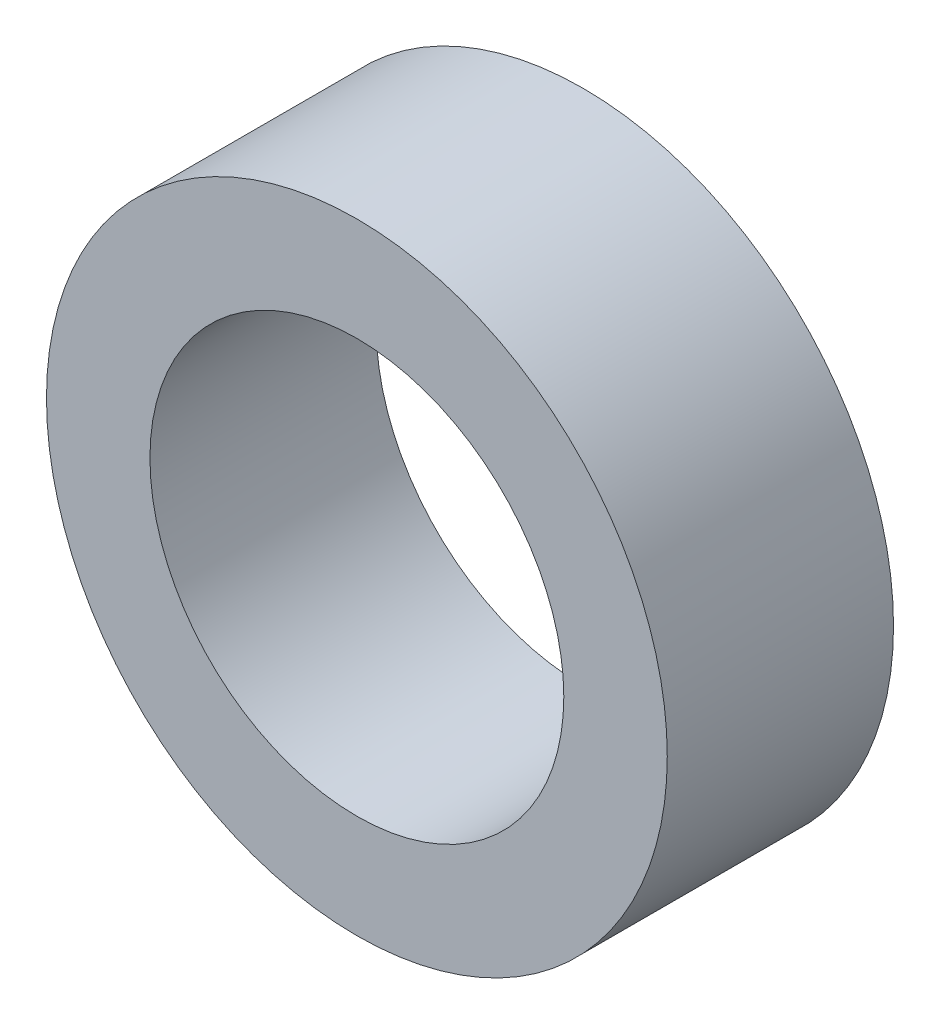
ISO-10303-21;
HEADER;
FILE_DESCRIPTION(('STEP AP214'),'2;1');
FILE_NAME('part.step','',(''),(''),'','','');
FILE_SCHEMA(('AUTOMOTIVE_DESIGN { 1 0 10303 214 1 1 1 1 }'));
ENDSEC;
DATA;
#1=APPLICATION_CONTEXT('core data for automotive mechanical design processes');
#2=APPLICATION_PROTOCOL_DEFINITION('international standard','automotive_design',2000,#1);
#3=PRODUCT_CONTEXT('',#1,'mechanical');
#4=PRODUCT('Part','Part','',(#3));
#5=PRODUCT_RELATED_PRODUCT_CATEGORY('part','',(#4));
#6=PRODUCT_DEFINITION_FORMATION('','',#4);
#7=PRODUCT_DEFINITION_CONTEXT('part definition',#1,'design');
#8=PRODUCT_DEFINITION('design','',#6,#7);
#9=PRODUCT_DEFINITION_SHAPE('','',#8);
#10=(LENGTH_UNIT() NAMED_UNIT(*) SI_UNIT(.MILLI.,.METRE.));
#11=(NAMED_UNIT(*) PLANE_ANGLE_UNIT() SI_UNIT($,.RADIAN.));
#12=(NAMED_UNIT(*) SI_UNIT($,.STERADIAN.) SOLID_ANGLE_UNIT());
#13=UNCERTAINTY_MEASURE_WITH_UNIT(LENGTH_MEASURE(1.E-05),#10,'distance_accuracy_value','');
#14=(GEOMETRIC_REPRESENTATION_CONTEXT(3) GLOBAL_UNCERTAINTY_ASSIGNED_CONTEXT((#13)) GLOBAL_UNIT_ASSIGNED_CONTEXT((#10,
#11,#12)) REPRESENTATION_CONTEXT('',''));
#15=CARTESIAN_POINT('',(0.,0.,0.));
#16=DIRECTION('',(0.,0.,1.));
#17=DIRECTION('',(1.,0.,0.));
#18=AXIS2_PLACEMENT_3D('',#15,#16,#17);
#19=CARTESIAN_POINT('',(-17.7,-16.75,1.64));
#20=DIRECTION('',(0.,0.,1.));
#21=DIRECTION('',(1.,0.,0.));
#22=AXIS2_PLACEMENT_3D('',#19,#20,#21);
#23=PLANE('',#22);
#24=CARTESIAN_POINT('',(-32.9,-2.5,1.64));
#25=DIRECTION('',(0.,0.,1.));
#26=DIRECTION('',(1.,0.,0.));
#27=AXIS2_PLACEMENT_3D('',#24,#25,#26);
#28=CIRCLE('',#27,1.5);
#29=CARTESIAN_POINT('',(-31.4,-2.5,1.64));
#30=VERTEX_POINT('',#29);
#31=EDGE_CURVE('E47',#30,#30,#28,.T.);
#32=ORIENTED_EDGE('',*,*,#31,.F.);
#33=EDGE_LOOP('',(#32));
#34=FACE_BOUND('',#33,.T.);
#35=CARTESIAN_POINT('',(-32.9,-2.5,1.64));
#36=DIRECTION('',(0.,0.,1.));
#37=DIRECTION('',(1.,0.,0.));
#38=AXIS2_PLACEMENT_3D('',#35,#36,#37);
#39=CIRCLE('',#38,2.25);
#40=CARTESIAN_POINT('',(-30.65,-2.5,1.64));
#41=VERTEX_POINT('',#40);
#42=EDGE_CURVE('E11',#41,#41,#39,.T.);
#43=ORIENTED_EDGE('',*,*,#42,.T.);
#44=EDGE_LOOP('',(#43));
#45=FACE_BOUND('',#44,.T.);
#46=ADVANCED_FACE('F17',(#34,#45),#23,.T.);
#47=CARTESIAN_POINT('',(-17.7,-16.75,0.));
#48=DIRECTION('',(0.,0.,1.));
#49=DIRECTION('',(1.,0.,0.));
#50=AXIS2_PLACEMENT_3D('',#47,#48,#49);
#51=PLANE('',#50);
#52=CARTESIAN_POINT('',(-32.9,-2.5,0.));
#53=DIRECTION('',(0.,0.,1.));
#54=DIRECTION('',(1.,0.,0.));
#55=AXIS2_PLACEMENT_3D('',#52,#53,#54);
#56=CIRCLE('',#55,1.5);
#57=CARTESIAN_POINT('',(-31.4,-2.5,0.));
#58=VERTEX_POINT('',#57);
#59=EDGE_CURVE('E21',#58,#58,#56,.T.);
#60=ORIENTED_EDGE('',*,*,#59,.T.);
#61=EDGE_LOOP('',(#60));
#62=FACE_BOUND('',#61,.T.);
#63=CARTESIAN_POINT('',(-32.9,-2.5,0.));
#64=DIRECTION('',(0.,0.,1.));
#65=DIRECTION('',(1.,0.,0.));
#66=AXIS2_PLACEMENT_3D('',#63,#64,#65);
#67=CIRCLE('',#66,2.25);
#68=CARTESIAN_POINT('',(-30.65,-2.5,0.));
#69=VERTEX_POINT('',#68);
#70=EDGE_CURVE('E28',#69,#69,#67,.T.);
#71=ORIENTED_EDGE('',*,*,#70,.F.);
#72=EDGE_LOOP('',(#71));
#73=FACE_BOUND('',#72,.T.);
#74=ADVANCED_FACE('F54',(#62,#73),#51,.F.);
#75=CARTESIAN_POINT('',(-32.9,-2.5,1.64));
#76=DIRECTION('',(0.,0.,1.));
#77=DIRECTION('',(-1.,0.,0.));
#78=AXIS2_PLACEMENT_3D('',#75,#76,#77);
#79=CYLINDRICAL_SURFACE('',#78,2.25);
#80=ORIENTED_EDGE('',*,*,#42,.F.);
#81=EDGE_LOOP('',(#80));
#82=FACE_BOUND('',#81,.T.);
#83=ORIENTED_EDGE('',*,*,#70,.T.);
#84=EDGE_LOOP('',(#83));
#85=FACE_BOUND('',#84,.T.);
#86=ADVANCED_FACE('F67',(#82,#85),#79,.T.);
#87=CARTESIAN_POINT('',(-32.9,-2.5,1.64));
#88=DIRECTION('',(0.,0.,1.));
#89=DIRECTION('',(-1.,0.,0.));
#90=AXIS2_PLACEMENT_3D('',#87,#88,#89);
#91=CYLINDRICAL_SURFACE('',#90,1.5);
#92=ORIENTED_EDGE('',*,*,#31,.T.);
#93=EDGE_LOOP('',(#92));
#94=FACE_BOUND('',#93,.T.);
#95=ORIENTED_EDGE('',*,*,#59,.F.);
#96=EDGE_LOOP('',(#95));
#97=FACE_BOUND('',#96,.T.);
#98=ADVANCED_FACE('F19',(#94,#97),#91,.F.);
#99=CLOSED_SHELL('',(#46,#74,#86,#98));
#100=MANIFOLD_SOLID_BREP('B1',#99);
#101=ADVANCED_BREP_SHAPE_REPRESENTATION('',(#18,#100),#14);
#102=SHAPE_DEFINITION_REPRESENTATION(#9,#101);
ENDSEC;
END-ISO-10303-21;
